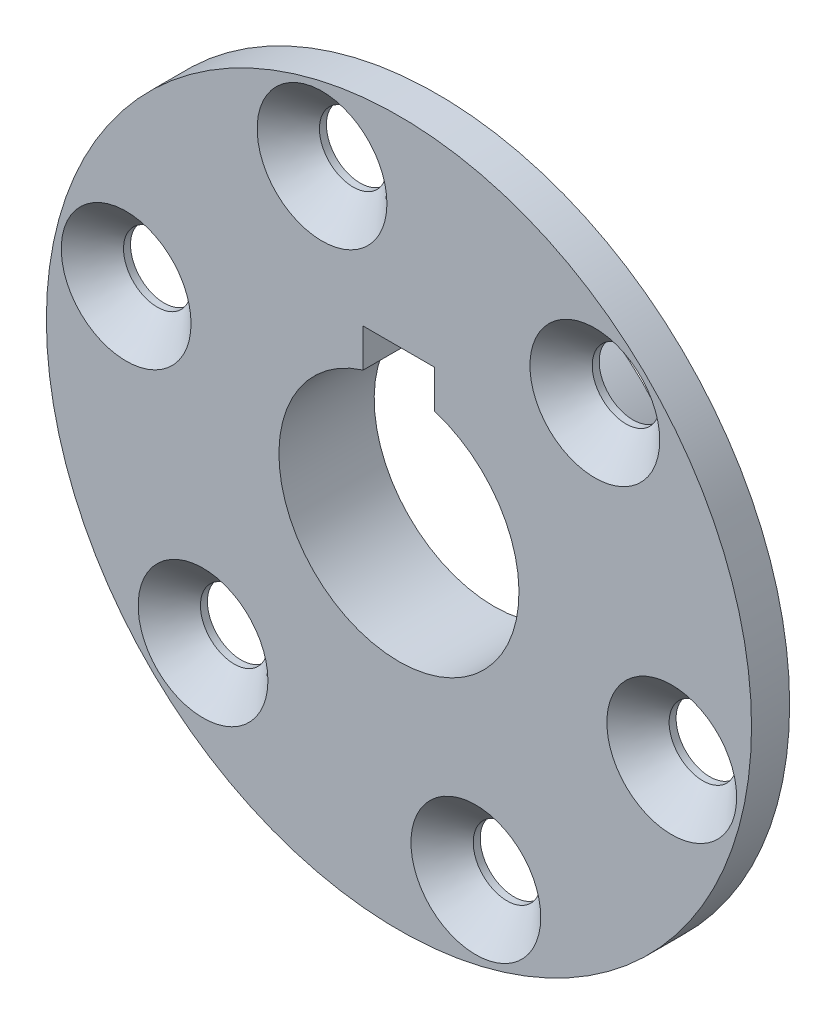
ISO-10303-21;
HEADER;
FILE_DESCRIPTION(('STEP AP214'),'2;1');
FILE_NAME('part.step','',(''),(''),'','','');
FILE_SCHEMA(('AUTOMOTIVE_DESIGN { 1 0 10303 214 1 1 1 1 }'));
ENDSEC;
DATA;
#1=APPLICATION_CONTEXT('core data for automotive mechanical design processes');
#2=APPLICATION_PROTOCOL_DEFINITION('international standard','automotive_design',2000,#1);
#3=PRODUCT_CONTEXT('',#1,'mechanical');
#4=PRODUCT('Part','Part','',(#3));
#5=PRODUCT_RELATED_PRODUCT_CATEGORY('part','',(#4));
#6=PRODUCT_DEFINITION_FORMATION('','',#4);
#7=PRODUCT_DEFINITION_CONTEXT('part definition',#1,'design');
#8=PRODUCT_DEFINITION('design','',#6,#7);
#9=PRODUCT_DEFINITION_SHAPE('','',#8);
#10=(LENGTH_UNIT() NAMED_UNIT(*) SI_UNIT(.MILLI.,.METRE.));
#11=(NAMED_UNIT(*) PLANE_ANGLE_UNIT() SI_UNIT($,.RADIAN.));
#12=(NAMED_UNIT(*) SI_UNIT($,.STERADIAN.) SOLID_ANGLE_UNIT());
#13=UNCERTAINTY_MEASURE_WITH_UNIT(LENGTH_MEASURE(1.E-05),#10,'distance_accuracy_value','');
#14=(GEOMETRIC_REPRESENTATION_CONTEXT(3) GLOBAL_UNCERTAINTY_ASSIGNED_CONTEXT((#13)) GLOBAL_UNIT_ASSIGNED_CONTEXT((#10,
#11,#12)) REPRESENTATION_CONTEXT('',''));
#15=CARTESIAN_POINT('',(0.,0.,0.));
#16=DIRECTION('',(0.,0.,1.));
#17=DIRECTION('',(1.,0.,0.));
#18=AXIS2_PLACEMENT_3D('',#15,#16,#17);
#19=CARTESIAN_POINT('',(4.7625,0.,5.08));
#20=DIRECTION('',(1.,0.,0.));
#21=DIRECTION('',(0.,1.,0.));
#22=AXIS2_PLACEMENT_3D('',#19,#20,#21);
#23=PLANE('',#22);
#24=DIRECTION('',(0.,0.,-1.));
#25=VECTOR('',#24,1.);
#26=CARTESIAN_POINT('',(4.7625,20.3547698427832,5.08));
#27=LINE('',#26,#25);
#28=CARTESIAN_POINT('',(4.7625,20.3547698427832,5.08));
#29=VERTEX_POINT('',#28);
#30=CARTESIAN_POINT('',(4.7625,20.3547698427832,-7.62));
#31=VERTEX_POINT('',#30);
#32=EDGE_CURVE('E89',#29,#31,#27,.T.);
#33=ORIENTED_EDGE('',*,*,#32,.T.);
#34=DIRECTION('',(0.,1.,0.));
#35=VECTOR('',#34,1.);
#36=CARTESIAN_POINT('',(4.7625,0.,-7.62));
#37=LINE('',#36,#35);
#38=CARTESIAN_POINT('',(4.7625,15.2747698427832,-7.62));
#39=VERTEX_POINT('',#38);
#40=EDGE_CURVE('E88',#39,#31,#37,.T.);
#41=ORIENTED_EDGE('',*,*,#40,.F.);
#42=DIRECTION('',(0.,0.,-1.));
#43=VECTOR('',#42,1.);
#44=CARTESIAN_POINT('',(4.7625,15.2747698427832,5.08));
#45=LINE('',#44,#43);
#46=CARTESIAN_POINT('',(4.7625,15.2747698427832,5.08));
#47=VERTEX_POINT('',#46);
#48=EDGE_CURVE('E43',#47,#39,#45,.T.);
#49=ORIENTED_EDGE('',*,*,#48,.F.);
#50=DIRECTION('',(0.,-1.,0.));
#51=VECTOR('',#50,1.);
#52=CARTESIAN_POINT('',(4.7625,0.,5.08));
#53=LINE('',#52,#51);
#54=EDGE_CURVE('E164',#29,#47,#53,.T.);
#55=ORIENTED_EDGE('',*,*,#54,.F.);
#56=EDGE_LOOP('',(#33,#41,#49,#55));
#57=FACE_BOUND('',#56,.T.);
#58=ADVANCED_FACE('F35',(#57),#23,.F.);
#59=CARTESIAN_POINT('',(0.,0.,5.08));
#60=DIRECTION('',(0.,0.,-1.));
#61=DIRECTION('',(-1.,0.,0.));
#62=AXIS2_PLACEMENT_3D('',#59,#60,#61);
#63=CYLINDRICAL_SURFACE('',#62,16.);
#64=ORIENTED_EDGE('',*,*,#48,.T.);
#65=CARTESIAN_POINT('',(0.,0.,-7.62));
#66=DIRECTION('',(0.,0.,-1.));
#67=DIRECTION('',(-1.,0.,0.));
#68=AXIS2_PLACEMENT_3D('',#65,#66,#67);
#69=CIRCLE('',#68,16.);
#70=CARTESIAN_POINT('',(-4.7625,15.2747698427832,-7.62));
#71=VERTEX_POINT('',#70);
#72=EDGE_CURVE('E82',#71,#39,#69,.F.);
#73=ORIENTED_EDGE('',*,*,#72,.F.);
#74=DIRECTION('',(0.,0.,-1.));
#75=VECTOR('',#74,1.);
#76=CARTESIAN_POINT('',(-4.7625,15.2747698427832,5.08));
#77=LINE('',#76,#75);
#78=CARTESIAN_POINT('',(-4.7625,15.2747698427832,5.08));
#79=VERTEX_POINT('',#78);
#80=EDGE_CURVE('E86',#79,#71,#77,.T.);
#81=ORIENTED_EDGE('',*,*,#80,.F.);
#82=CARTESIAN_POINT('',(0.,0.,5.08));
#83=DIRECTION('',(0.,0.,1.));
#84=DIRECTION('',(1.,0.,0.));
#85=AXIS2_PLACEMENT_3D('',#82,#83,#84);
#86=CIRCLE('',#85,16.);
#87=EDGE_CURVE('E83',#47,#79,#86,.F.);
#88=ORIENTED_EDGE('',*,*,#87,.F.);
#89=EDGE_LOOP('',(#64,#73,#81,#88));
#90=FACE_BOUND('',#89,.T.);
#91=ADVANCED_FACE('F79',(#90),#63,.F.);
#92=CARTESIAN_POINT('',(-4.7625,0.,5.08));
#93=DIRECTION('',(1.,0.,0.));
#94=DIRECTION('',(0.,1.,0.));
#95=AXIS2_PLACEMENT_3D('',#92,#93,#94);
#96=PLANE('',#95);
#97=ORIENTED_EDGE('',*,*,#80,.T.);
#98=DIRECTION('',(0.,-1.,0.));
#99=VECTOR('',#98,1.);
#100=CARTESIAN_POINT('',(-4.7625,0.,-7.62));
#101=LINE('',#100,#99);
#102=CARTESIAN_POINT('',(-4.7625,20.3547698427832,-7.62));
#103=VERTEX_POINT('',#102);
#104=EDGE_CURVE('E98',#103,#71,#101,.T.);
#105=ORIENTED_EDGE('',*,*,#104,.F.);
#106=DIRECTION('',(0.,0.,-1.));
#107=VECTOR('',#106,1.);
#108=CARTESIAN_POINT('',(-4.7625,20.3547698427832,5.08));
#109=LINE('',#108,#107);
#110=CARTESIAN_POINT('',(-4.7625,20.3547698427832,5.08));
#111=VERTEX_POINT('',#110);
#112=EDGE_CURVE('E58',#111,#103,#109,.T.);
#113=ORIENTED_EDGE('',*,*,#112,.F.);
#114=DIRECTION('',(0.,-1.,0.));
#115=VECTOR('',#114,1.);
#116=CARTESIAN_POINT('',(-4.7625,0.,5.08));
#117=LINE('',#116,#115);
#118=EDGE_CURVE('E167',#111,#79,#117,.T.);
#119=ORIENTED_EDGE('',*,*,#118,.T.);
#120=EDGE_LOOP('',(#97,#105,#113,#119));
#121=FACE_BOUND('',#120,.T.);
#122=ADVANCED_FACE('F174',(#121),#96,.T.);
#123=CARTESIAN_POINT('',(0.,0.,5.08));
#124=DIRECTION('',(0.,0.,-1.));
#125=DIRECTION('',(-1.,0.,0.));
#126=AXIS2_PLACEMENT_3D('',#123,#124,#125);
#127=CYLINDRICAL_SURFACE('',#126,47.);
#128=CARTESIAN_POINT('',(0.,0.,5.08));
#129=DIRECTION('',(0.,0.,1.));
#130=DIRECTION('',(1.,0.,0.));
#131=AXIS2_PLACEMENT_3D('',#128,#129,#130);
#132=CIRCLE('',#131,47.);
#133=CARTESIAN_POINT('',(47.,0.,5.08));
#134=VERTEX_POINT('',#133);
#135=EDGE_CURVE('E161',#134,#134,#132,.T.);
#136=ORIENTED_EDGE('',*,*,#135,.F.);
#137=EDGE_LOOP('',(#136));
#138=FACE_BOUND('',#137,.T.);
#139=CARTESIAN_POINT('',(0.,0.,0.));
#140=DIRECTION('',(0.,0.,1.));
#141=DIRECTION('',(1.,0.,0.));
#142=AXIS2_PLACEMENT_3D('',#139,#140,#141);
#143=CIRCLE('',#142,47.);
#144=CARTESIAN_POINT('',(47.,0.,0.));
#145=VERTEX_POINT('',#144);
#146=EDGE_CURVE('E160',#145,#145,#143,.T.);
#147=ORIENTED_EDGE('',*,*,#146,.T.);
#148=EDGE_LOOP('',(#147));
#149=FACE_BOUND('',#148,.T.);
#150=ADVANCED_FACE('F37',(#138,#149),#127,.T.);
#151=CARTESIAN_POINT('',(0.,20.3547698427832,5.08));
#152=DIRECTION('',(0.,1.,0.));
#153=DIRECTION('',(0.,0.,1.));
#154=AXIS2_PLACEMENT_3D('',#151,#152,#153);
#155=PLANE('',#154);
#156=ORIENTED_EDGE('',*,*,#112,.T.);
#157=DIRECTION('',(-1.,0.,0.));
#158=VECTOR('',#157,1.);
#159=CARTESIAN_POINT('',(0.,20.3547698427832,-7.62));
#160=LINE('',#159,#158);
#161=EDGE_CURVE('E93',#31,#103,#160,.T.);
#162=ORIENTED_EDGE('',*,*,#161,.F.);
#163=ORIENTED_EDGE('',*,*,#32,.F.);
#164=DIRECTION('',(1.,0.,0.));
#165=VECTOR('',#164,1.);
#166=CARTESIAN_POINT('',(0.,20.3547698427832,5.08));
#167=LINE('',#166,#165);
#168=EDGE_CURVE('E50',#111,#29,#167,.T.);
#169=ORIENTED_EDGE('',*,*,#168,.F.);
#170=EDGE_LOOP('',(#156,#162,#163,#169));
#171=FACE_BOUND('',#170,.T.);
#172=ADVANCED_FACE('F178',(#171),#155,.F.);
#173=CARTESIAN_POINT('',(0.,0.,5.08));
#174=DIRECTION('',(0.,0.,1.));
#175=DIRECTION('',(1.,0.,0.));
#176=AXIS2_PLACEMENT_3D('',#173,#174,#175);
#177=PLANE('',#176);
#178=CARTESIAN_POINT('',(-10.2514846865282,36.0715547450048,5.08));
#179=DIRECTION('',(0.,0.,1.));
#180=DIRECTION('',(1.,0.,0.));
#181=AXIS2_PLACEMENT_3D('',#178,#179,#180);
#182=CIRCLE('',#181,8.65);
#183=CARTESIAN_POINT('',(-1.60148468652819,36.0715547450048,5.08));
#184=VERTEX_POINT('',#183);
#185=EDGE_CURVE('E106',#184,#184,#182,.T.);
#186=ORIENTED_EDGE('',*,*,#185,.F.);
#187=EDGE_LOOP('',(#186));
#188=FACE_BOUND('',#187,.T.);
#189=CARTESIAN_POINT('',(26.1131404199116,26.9138235375445,5.08));
#190=DIRECTION('',(0.,0.,1.));
#191=DIRECTION('',(1.,0.,0.));
#192=AXIS2_PLACEMENT_3D('',#189,#190,#191);
#193=CIRCLE('',#192,8.65);
#194=CARTESIAN_POINT('',(34.7631404199116,26.9138235375445,5.08));
#195=VERTEX_POINT('',#194);
#196=EDGE_CURVE('E115',#195,#195,#193,.T.);
#197=ORIENTED_EDGE('',*,*,#196,.F.);
#198=EDGE_LOOP('',(#197));
#199=FACE_BOUND('',#198,.T.);
#200=CARTESIAN_POINT('',(-36.3646251064383,9.15773120746069,5.08));
#201=DIRECTION('',(0.,0.,1.));
#202=DIRECTION('',(1.,0.,0.));
#203=AXIS2_PLACEMENT_3D('',#200,#201,#202);
#204=CIRCLE('',#203,8.65);
#205=CARTESIAN_POINT('',(-27.7146251064383,9.15773120746069,5.08));
#206=VERTEX_POINT('',#205);
#207=EDGE_CURVE('E124',#206,#206,#204,.T.);
#208=ORIENTED_EDGE('',*,*,#207,.F.);
#209=EDGE_LOOP('',(#208));
#210=FACE_BOUND('',#209,.T.);
#211=CARTESIAN_POINT('',(36.3646251064413,-9.15773120745989,5.08));
#212=DIRECTION('',(0.,0.,1.));
#213=DIRECTION('',(1.,0.,0.));
#214=AXIS2_PLACEMENT_3D('',#211,#212,#213);
#215=CIRCLE('',#214,8.65);
#216=CARTESIAN_POINT('',(45.0146251064413,-9.15773120745989,5.08));
#217=VERTEX_POINT('',#216);
#218=EDGE_CURVE('E133',#217,#217,#215,.T.);
#219=ORIENTED_EDGE('',*,*,#218,.F.);
#220=EDGE_LOOP('',(#219));
#221=FACE_BOUND('',#220,.T.);
#222=CARTESIAN_POINT('',(10.2514846865312,-36.071554745004,5.08));
#223=DIRECTION('',(0.,0.,1.));
#224=DIRECTION('',(1.,0.,0.));
#225=AXIS2_PLACEMENT_3D('',#222,#223,#224);
#226=CIRCLE('',#225,8.65);
#227=CARTESIAN_POINT('',(18.9014846865312,-36.071554745004,5.08));
#228=VERTEX_POINT('',#227);
#229=EDGE_CURVE('E142',#228,#228,#226,.T.);
#230=ORIENTED_EDGE('',*,*,#229,.F.);
#231=EDGE_LOOP('',(#230));
#232=FACE_BOUND('',#231,.T.);
#233=CARTESIAN_POINT('',(-26.1131404199085,-26.9138235375437,5.08));
#234=DIRECTION('',(0.,0.,1.));
#235=DIRECTION('',(1.,0.,0.));
#236=AXIS2_PLACEMENT_3D('',#233,#234,#235);
#237=CIRCLE('',#236,8.65);
#238=CARTESIAN_POINT('',(-17.4631404199085,-26.9138235375437,5.08));
#239=VERTEX_POINT('',#238);
#240=EDGE_CURVE('E151',#239,#239,#237,.T.);
#241=ORIENTED_EDGE('',*,*,#240,.F.);
#242=EDGE_LOOP('',(#241));
#243=FACE_BOUND('',#242,.T.);
#244=ORIENTED_EDGE('',*,*,#135,.T.);
#245=EDGE_LOOP('',(#244));
#246=FACE_BOUND('',#245,.T.);
#247=ORIENTED_EDGE('',*,*,#54,.T.);
#248=ORIENTED_EDGE('',*,*,#87,.T.);
#249=ORIENTED_EDGE('',*,*,#118,.F.);
#250=ORIENTED_EDGE('',*,*,#168,.T.);
#251=EDGE_LOOP('',(#247,#248,#249,#250));
#252=FACE_BOUND('',#251,.T.);
#253=ADVANCED_FACE('F175',(#188,#199,#210,#221,#232,#243,#246,#252),#177,.T.);
#254=CARTESIAN_POINT('',(0.,0.,0.));
#255=DIRECTION('',(0.,0.,1.));
#256=DIRECTION('',(1.,0.,0.));
#257=AXIS2_PLACEMENT_3D('',#254,#255,#256);
#258=PLANE('',#257);
#259=CARTESIAN_POINT('',(0.,0.,0.));
#260=DIRECTION('',(0.,0.,1.));
#261=DIRECTION('',(1.,0.,0.));
#262=AXIS2_PLACEMENT_3D('',#259,#260,#261);
#263=CIRCLE('',#262,27.94);
#264=CARTESIAN_POINT('',(27.94,0.,0.));
#265=VERTEX_POINT('',#264);
#266=EDGE_CURVE('E11',#265,#265,#263,.F.);
#267=ORIENTED_EDGE('',*,*,#266,.F.);
#268=EDGE_LOOP('',(#267));
#269=FACE_BOUND('',#268,.T.);
#270=CARTESIAN_POINT('',(-10.2514846865282,36.0715547450048,0.));
#271=DIRECTION('',(0.,0.,1.));
#272=DIRECTION('',(1.,0.,0.));
#273=AXIS2_PLACEMENT_3D('',#270,#271,#272);
#274=CIRCLE('',#273,4.5);
#275=CARTESIAN_POINT('',(-5.75148468652819,36.0715547450048,0.));
#276=VERTEX_POINT('',#275);
#277=EDGE_CURVE('E112',#276,#276,#274,.T.);
#278=ORIENTED_EDGE('',*,*,#277,.T.);
#279=EDGE_LOOP('',(#278));
#280=FACE_BOUND('',#279,.T.);
#281=CARTESIAN_POINT('',(26.1131404199116,26.9138235375445,0.));
#282=DIRECTION('',(0.,0.,1.));
#283=DIRECTION('',(1.,0.,0.));
#284=AXIS2_PLACEMENT_3D('',#281,#282,#283);
#285=CIRCLE('',#284,4.5);
#286=CARTESIAN_POINT('',(30.6131404199116,26.9138235375445,0.));
#287=VERTEX_POINT('',#286);
#288=EDGE_CURVE('E121',#287,#287,#285,.T.);
#289=ORIENTED_EDGE('',*,*,#288,.T.);
#290=EDGE_LOOP('',(#289));
#291=FACE_BOUND('',#290,.T.);
#292=CARTESIAN_POINT('',(-36.3646251064383,9.15773120746069,0.));
#293=DIRECTION('',(0.,0.,1.));
#294=DIRECTION('',(1.,0.,0.));
#295=AXIS2_PLACEMENT_3D('',#292,#293,#294);
#296=CIRCLE('',#295,4.5);
#297=CARTESIAN_POINT('',(-31.8646251064383,9.15773120746069,0.));
#298=VERTEX_POINT('',#297);
#299=EDGE_CURVE('E130',#298,#298,#296,.T.);
#300=ORIENTED_EDGE('',*,*,#299,.T.);
#301=EDGE_LOOP('',(#300));
#302=FACE_BOUND('',#301,.T.);
#303=CARTESIAN_POINT('',(36.3646251064413,-9.15773120745989,0.));
#304=DIRECTION('',(0.,0.,1.));
#305=DIRECTION('',(1.,0.,0.));
#306=AXIS2_PLACEMENT_3D('',#303,#304,#305);
#307=CIRCLE('',#306,4.5);
#308=CARTESIAN_POINT('',(40.8646251064413,-9.15773120745989,0.));
#309=VERTEX_POINT('',#308);
#310=EDGE_CURVE('E139',#309,#309,#307,.T.);
#311=ORIENTED_EDGE('',*,*,#310,.T.);
#312=EDGE_LOOP('',(#311));
#313=FACE_BOUND('',#312,.T.);
#314=CARTESIAN_POINT('',(10.2514846865312,-36.071554745004,0.));
#315=DIRECTION('',(0.,0.,1.));
#316=DIRECTION('',(1.,0.,0.));
#317=AXIS2_PLACEMENT_3D('',#314,#315,#316);
#318=CIRCLE('',#317,4.5);
#319=CARTESIAN_POINT('',(14.7514846865312,-36.071554745004,0.));
#320=VERTEX_POINT('',#319);
#321=EDGE_CURVE('E148',#320,#320,#318,.T.);
#322=ORIENTED_EDGE('',*,*,#321,.T.);
#323=EDGE_LOOP('',(#322));
#324=FACE_BOUND('',#323,.T.);
#325=CARTESIAN_POINT('',(-26.1131404199085,-26.9138235375437,0.));
#326=DIRECTION('',(0.,0.,1.));
#327=DIRECTION('',(1.,0.,0.));
#328=AXIS2_PLACEMENT_3D('',#325,#326,#327);
#329=CIRCLE('',#328,4.5);
#330=CARTESIAN_POINT('',(-21.6131404199085,-26.9138235375437,0.));
#331=VERTEX_POINT('',#330);
#332=EDGE_CURVE('E157',#331,#331,#329,.T.);
#333=ORIENTED_EDGE('',*,*,#332,.T.);
#334=EDGE_LOOP('',(#333));
#335=FACE_BOUND('',#334,.T.);
#336=ORIENTED_EDGE('',*,*,#146,.F.);
#337=EDGE_LOOP('',(#336));
#338=FACE_BOUND('',#337,.T.);
#339=ADVANCED_FACE('F177',(#269,#280,#291,#302,#313,#324,#335,#338),#258,.F.);
#340=CARTESIAN_POINT('',(-26.1131404199085,-26.9138235375437,5.08));
#341=DIRECTION('',(0.,0.,1.));
#342=DIRECTION('',(1.,0.,0.));
#343=AXIS2_PLACEMENT_3D('',#340,#341,#342);
#344=CYLINDRICAL_SURFACE('',#343,4.5);
#345=ORIENTED_EDGE('',*,*,#332,.F.);
#346=EDGE_LOOP('',(#345));
#347=FACE_BOUND('',#346,.T.);
#348=CARTESIAN_POINT('',(-26.1131404199085,-26.9138235375437,0.930000000000003));
#349=DIRECTION('',(0.,0.,1.));
#350=DIRECTION('',(1.,0.,0.));
#351=AXIS2_PLACEMENT_3D('',#348,#349,#350);
#352=CIRCLE('',#351,4.5);
#353=CARTESIAN_POINT('',(-21.6131404199085,-26.9138235375437,0.930000000000003));
#354=VERTEX_POINT('',#353);
#355=EDGE_CURVE('E154',#354,#354,#352,.T.);
#356=ORIENTED_EDGE('',*,*,#355,.T.);
#357=EDGE_LOOP('',(#356));
#358=FACE_BOUND('',#357,.T.);
#359=ADVANCED_FACE('F185',(#347,#358),#344,.F.);
#360=CARTESIAN_POINT('',(-26.1131404199085,-26.9138235375437,5.08));
#361=DIRECTION('',(0.,0.,1.));
#362=DIRECTION('',(1.,0.,0.));
#363=AXIS2_PLACEMENT_3D('',#360,#361,#362);
#364=CONICAL_SURFACE('',#363,8.65,0.785398163397449);
#365=ORIENTED_EDGE('',*,*,#355,.F.);
#366=EDGE_LOOP('',(#365));
#367=FACE_BOUND('',#366,.T.);
#368=ORIENTED_EDGE('',*,*,#240,.T.);
#369=EDGE_LOOP('',(#368));
#370=FACE_BOUND('',#369,.T.);
#371=ADVANCED_FACE('F290',(#367,#370),#364,.F.);
#372=CARTESIAN_POINT('',(10.2514846865312,-36.071554745004,5.08));
#373=DIRECTION('',(0.,0.,1.));
#374=DIRECTION('',(1.,0.,0.));
#375=AXIS2_PLACEMENT_3D('',#372,#373,#374);
#376=CYLINDRICAL_SURFACE('',#375,4.5);
#377=ORIENTED_EDGE('',*,*,#321,.F.);
#378=EDGE_LOOP('',(#377));
#379=FACE_BOUND('',#378,.T.);
#380=CARTESIAN_POINT('',(10.2514846865312,-36.071554745004,0.930000000000003));
#381=DIRECTION('',(0.,0.,1.));
#382=DIRECTION('',(1.,0.,0.));
#383=AXIS2_PLACEMENT_3D('',#380,#381,#382);
#384=CIRCLE('',#383,4.5);
#385=CARTESIAN_POINT('',(14.7514846865312,-36.071554745004,0.930000000000003));
#386=VERTEX_POINT('',#385);
#387=EDGE_CURVE('E145',#386,#386,#384,.T.);
#388=ORIENTED_EDGE('',*,*,#387,.T.);
#389=EDGE_LOOP('',(#388));
#390=FACE_BOUND('',#389,.T.);
#391=ADVANCED_FACE('F286',(#379,#390),#376,.F.);
#392=CARTESIAN_POINT('',(10.2514846865312,-36.071554745004,5.08));
#393=DIRECTION('',(0.,0.,1.));
#394=DIRECTION('',(1.,0.,0.));
#395=AXIS2_PLACEMENT_3D('',#392,#393,#394);
#396=CONICAL_SURFACE('',#395,8.65,0.785398163397449);
#397=ORIENTED_EDGE('',*,*,#387,.F.);
#398=EDGE_LOOP('',(#397));
#399=FACE_BOUND('',#398,.T.);
#400=ORIENTED_EDGE('',*,*,#229,.T.);
#401=EDGE_LOOP('',(#400));
#402=FACE_BOUND('',#401,.T.);
#403=ADVANCED_FACE('F282',(#399,#402),#396,.F.);
#404=CARTESIAN_POINT('',(36.3646251064413,-9.15773120745989,5.08));
#405=DIRECTION('',(0.,0.,1.));
#406=DIRECTION('',(1.,0.,0.));
#407=AXIS2_PLACEMENT_3D('',#404,#405,#406);
#408=CYLINDRICAL_SURFACE('',#407,4.5);
#409=ORIENTED_EDGE('',*,*,#310,.F.);
#410=EDGE_LOOP('',(#409));
#411=FACE_BOUND('',#410,.T.);
#412=CARTESIAN_POINT('',(36.3646251064413,-9.15773120745989,0.930000000000003));
#413=DIRECTION('',(0.,0.,1.));
#414=DIRECTION('',(1.,0.,0.));
#415=AXIS2_PLACEMENT_3D('',#412,#413,#414);
#416=CIRCLE('',#415,4.5);
#417=CARTESIAN_POINT('',(40.8646251064413,-9.15773120745989,0.930000000000003));
#418=VERTEX_POINT('',#417);
#419=EDGE_CURVE('E136',#418,#418,#416,.T.);
#420=ORIENTED_EDGE('',*,*,#419,.T.);
#421=EDGE_LOOP('',(#420));
#422=FACE_BOUND('',#421,.T.);
#423=ADVANCED_FACE('F278',(#411,#422),#408,.F.);
#424=CARTESIAN_POINT('',(36.3646251064413,-9.15773120745989,5.08));
#425=DIRECTION('',(0.,0.,1.));
#426=DIRECTION('',(1.,0.,0.));
#427=AXIS2_PLACEMENT_3D('',#424,#425,#426);
#428=CONICAL_SURFACE('',#427,8.65,0.785398163397449);
#429=ORIENTED_EDGE('',*,*,#419,.F.);
#430=EDGE_LOOP('',(#429));
#431=FACE_BOUND('',#430,.T.);
#432=ORIENTED_EDGE('',*,*,#218,.T.);
#433=EDGE_LOOP('',(#432));
#434=FACE_BOUND('',#433,.T.);
#435=ADVANCED_FACE('F274',(#431,#434),#428,.F.);
#436=CARTESIAN_POINT('',(-36.3646251064383,9.15773120746069,5.08));
#437=DIRECTION('',(0.,0.,1.));
#438=DIRECTION('',(1.,0.,0.));
#439=AXIS2_PLACEMENT_3D('',#436,#437,#438);
#440=CYLINDRICAL_SURFACE('',#439,4.5);
#441=ORIENTED_EDGE('',*,*,#299,.F.);
#442=EDGE_LOOP('',(#441));
#443=FACE_BOUND('',#442,.T.);
#444=CARTESIAN_POINT('',(-36.3646251064383,9.15773120746069,0.930000000000003));
#445=DIRECTION('',(0.,0.,1.));
#446=DIRECTION('',(1.,0.,0.));
#447=AXIS2_PLACEMENT_3D('',#444,#445,#446);
#448=CIRCLE('',#447,4.5);
#449=CARTESIAN_POINT('',(-31.8646251064383,9.15773120746069,0.930000000000003));
#450=VERTEX_POINT('',#449);
#451=EDGE_CURVE('E127',#450,#450,#448,.T.);
#452=ORIENTED_EDGE('',*,*,#451,.T.);
#453=EDGE_LOOP('',(#452));
#454=FACE_BOUND('',#453,.T.);
#455=ADVANCED_FACE('F270',(#443,#454),#440,.F.);
#456=CARTESIAN_POINT('',(-36.3646251064383,9.15773120746069,5.08));
#457=DIRECTION('',(0.,0.,1.));
#458=DIRECTION('',(1.,0.,0.));
#459=AXIS2_PLACEMENT_3D('',#456,#457,#458);
#460=CONICAL_SURFACE('',#459,8.65,0.785398163397449);
#461=ORIENTED_EDGE('',*,*,#451,.F.);
#462=EDGE_LOOP('',(#461));
#463=FACE_BOUND('',#462,.T.);
#464=ORIENTED_EDGE('',*,*,#207,.T.);
#465=EDGE_LOOP('',(#464));
#466=FACE_BOUND('',#465,.T.);
#467=ADVANCED_FACE('F266',(#463,#466),#460,.F.);
#468=CARTESIAN_POINT('',(26.1131404199116,26.9138235375445,5.08));
#469=DIRECTION('',(0.,0.,1.));
#470=DIRECTION('',(1.,0.,0.));
#471=AXIS2_PLACEMENT_3D('',#468,#469,#470);
#472=CYLINDRICAL_SURFACE('',#471,4.5);
#473=ORIENTED_EDGE('',*,*,#288,.F.);
#474=EDGE_LOOP('',(#473));
#475=FACE_BOUND('',#474,.T.);
#476=CARTESIAN_POINT('',(26.1131404199116,26.9138235375445,0.930000000000003));
#477=DIRECTION('',(0.,0.,1.));
#478=DIRECTION('',(1.,0.,0.));
#479=AXIS2_PLACEMENT_3D('',#476,#477,#478);
#480=CIRCLE('',#479,4.5);
#481=CARTESIAN_POINT('',(30.6131404199116,26.9138235375445,0.930000000000003));
#482=VERTEX_POINT('',#481);
#483=EDGE_CURVE('E118',#482,#482,#480,.T.);
#484=ORIENTED_EDGE('',*,*,#483,.T.);
#485=EDGE_LOOP('',(#484));
#486=FACE_BOUND('',#485,.T.);
#487=ADVANCED_FACE('F262',(#475,#486),#472,.F.);
#488=CARTESIAN_POINT('',(26.1131404199116,26.9138235375445,5.08));
#489=DIRECTION('',(0.,0.,1.));
#490=DIRECTION('',(1.,0.,0.));
#491=AXIS2_PLACEMENT_3D('',#488,#489,#490);
#492=CONICAL_SURFACE('',#491,8.65,0.785398163397448);
#493=ORIENTED_EDGE('',*,*,#483,.F.);
#494=EDGE_LOOP('',(#493));
#495=FACE_BOUND('',#494,.T.);
#496=ORIENTED_EDGE('',*,*,#196,.T.);
#497=EDGE_LOOP('',(#496));
#498=FACE_BOUND('',#497,.T.);
#499=ADVANCED_FACE('F258',(#495,#498),#492,.F.);
#500=CARTESIAN_POINT('',(-10.2514846865282,36.0715547450048,5.08));
#501=DIRECTION('',(0.,0.,1.));
#502=DIRECTION('',(1.,0.,0.));
#503=AXIS2_PLACEMENT_3D('',#500,#501,#502);
#504=CYLINDRICAL_SURFACE('',#503,4.5);
#505=ORIENTED_EDGE('',*,*,#277,.F.);
#506=EDGE_LOOP('',(#505));
#507=FACE_BOUND('',#506,.T.);
#508=CARTESIAN_POINT('',(-10.2514846865282,36.0715547450048,0.930000000000003));
#509=DIRECTION('',(0.,0.,1.));
#510=DIRECTION('',(1.,0.,0.));
#511=AXIS2_PLACEMENT_3D('',#508,#509,#510);
#512=CIRCLE('',#511,4.5);
#513=CARTESIAN_POINT('',(-5.75148468652819,36.0715547450048,0.930000000000003));
#514=VERTEX_POINT('',#513);
#515=EDGE_CURVE('E109',#514,#514,#512,.T.);
#516=ORIENTED_EDGE('',*,*,#515,.T.);
#517=EDGE_LOOP('',(#516));
#518=FACE_BOUND('',#517,.T.);
#519=ADVANCED_FACE('F254',(#507,#518),#504,.F.);
#520=CARTESIAN_POINT('',(-10.2514846865282,36.0715547450048,5.08));
#521=DIRECTION('',(0.,0.,1.));
#522=DIRECTION('',(1.,0.,0.));
#523=AXIS2_PLACEMENT_3D('',#520,#521,#522);
#524=CONICAL_SURFACE('',#523,8.65,0.785398163397449);
#525=ORIENTED_EDGE('',*,*,#515,.F.);
#526=EDGE_LOOP('',(#525));
#527=FACE_BOUND('',#526,.T.);
#528=ORIENTED_EDGE('',*,*,#185,.T.);
#529=EDGE_LOOP('',(#528));
#530=FACE_BOUND('',#529,.T.);
#531=ADVANCED_FACE('F238',(#527,#530),#524,.F.);
#532=CARTESIAN_POINT('',(0.,0.,-7.62));
#533=DIRECTION('',(0.,0.,1.));
#534=DIRECTION('',(1.,0.,0.));
#535=AXIS2_PLACEMENT_3D('',#532,#533,#534);
#536=CYLINDRICAL_SURFACE('',#535,27.94);
#537=CARTESIAN_POINT('',(0.,0.,-7.62));
#538=DIRECTION('',(0.,0.,-1.));
#539=DIRECTION('',(-1.,0.,0.));
#540=AXIS2_PLACEMENT_3D('',#537,#538,#539);
#541=CIRCLE('',#540,27.94);
#542=CARTESIAN_POINT('',(-27.94,0.,-7.62));
#543=VERTEX_POINT('',#542);
#544=EDGE_CURVE('E103',#543,#543,#541,.T.);
#545=ORIENTED_EDGE('',*,*,#544,.F.);
#546=EDGE_LOOP('',(#545));
#547=FACE_BOUND('',#546,.T.);
#548=ORIENTED_EDGE('',*,*,#266,.T.);
#549=EDGE_LOOP('',(#548));
#550=FACE_BOUND('',#549,.T.);
#551=ADVANCED_FACE('F234',(#547,#550),#536,.T.);
#552=CARTESIAN_POINT('',(0.,0.,-7.62));
#553=DIRECTION('',(0.,0.,-1.));
#554=DIRECTION('',(-1.,0.,0.));
#555=AXIS2_PLACEMENT_3D('',#552,#553,#554);
#556=PLANE('',#555);
#557=ORIENTED_EDGE('',*,*,#72,.T.);
#558=ORIENTED_EDGE('',*,*,#40,.T.);
#559=ORIENTED_EDGE('',*,*,#161,.T.);
#560=ORIENTED_EDGE('',*,*,#104,.T.);
#561=EDGE_LOOP('',(#557,#558,#559,#560));
#562=FACE_BOUND('',#561,.T.);
#563=ORIENTED_EDGE('',*,*,#544,.T.);
#564=EDGE_LOOP('',(#563));
#565=FACE_BOUND('',#564,.T.);
#566=ADVANCED_FACE('F96',(#562,#565),#556,.T.);
#567=CLOSED_SHELL('',(#58,#91,#122,#150,#172,#253,#339,#359,#371,#391,#403,#423,#435,#455,#467,
#487,#499,#519,#531,#551,#566));
#568=MANIFOLD_SOLID_BREP('B2',#567);
#569=ADVANCED_BREP_SHAPE_REPRESENTATION('',(#18,#568),#14);
#570=SHAPE_DEFINITION_REPRESENTATION(#9,#569);
ENDSEC;
END-ISO-10303-21;
